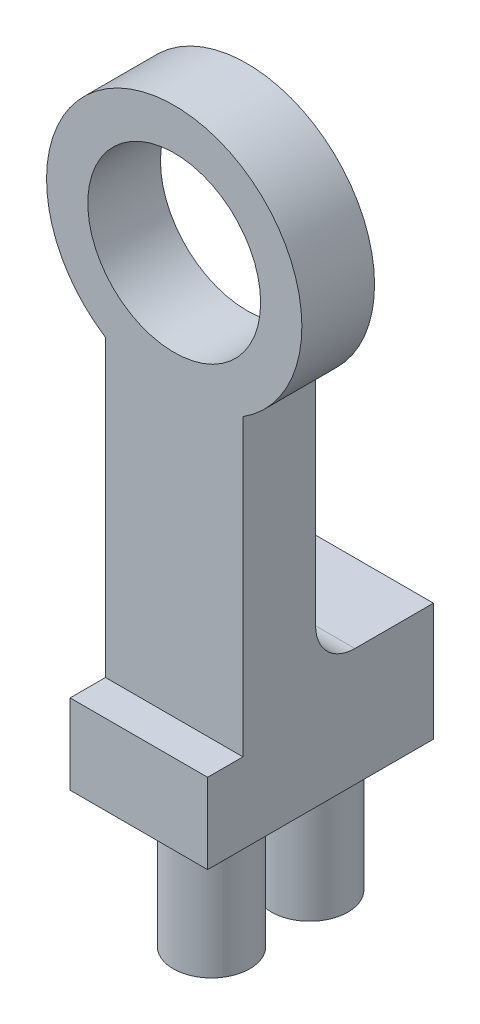
ISO-10303-21;
HEADER;
FILE_DESCRIPTION(('STEP AP214'),'2;1');
FILE_NAME('part.step','',(''),(''),'','','');
FILE_SCHEMA(('AUTOMOTIVE_DESIGN { 1 0 10303 214 1 1 1 1 }'));
ENDSEC;
DATA;
#1=APPLICATION_CONTEXT('core data for automotive mechanical design processes');
#2=APPLICATION_PROTOCOL_DEFINITION('international standard','automotive_design',2000,#1);
#3=PRODUCT_CONTEXT('',#1,'mechanical');
#4=PRODUCT('Part','Part','',(#3));
#5=PRODUCT_RELATED_PRODUCT_CATEGORY('part','',(#4));
#6=PRODUCT_DEFINITION_FORMATION('','',#4);
#7=PRODUCT_DEFINITION_CONTEXT('part definition',#1,'design');
#8=PRODUCT_DEFINITION('design','',#6,#7);
#9=PRODUCT_DEFINITION_SHAPE('','',#8);
#10=(LENGTH_UNIT() NAMED_UNIT(*) SI_UNIT(.MILLI.,.METRE.));
#11=(NAMED_UNIT(*) PLANE_ANGLE_UNIT() SI_UNIT($,.RADIAN.));
#12=(NAMED_UNIT(*) SI_UNIT($,.STERADIAN.) SOLID_ANGLE_UNIT());
#13=UNCERTAINTY_MEASURE_WITH_UNIT(LENGTH_MEASURE(1.E-05),#10,'distance_accuracy_value','');
#14=(GEOMETRIC_REPRESENTATION_CONTEXT(3) GLOBAL_UNCERTAINTY_ASSIGNED_CONTEXT((#13)) GLOBAL_UNIT_ASSIGNED_CONTEXT((#10,
#11,#12)) REPRESENTATION_CONTEXT('',''));
#15=CARTESIAN_POINT('',(0.,0.,0.));
#16=DIRECTION('',(0.,0.,1.));
#17=DIRECTION('',(1.,0.,0.));
#18=AXIS2_PLACEMENT_3D('',#15,#16,#17);
#19=CARTESIAN_POINT('',(0.,0.,3.7));
#20=DIRECTION('',(0.,0.,-1.));
#21=DIRECTION('',(-1.,0.,0.));
#22=AXIS2_PLACEMENT_3D('',#19,#20,#21);
#23=CYLINDRICAL_SURFACE('',#22,6.5);
#24=CARTESIAN_POINT('',(0.,0.,4.3));
#25=DIRECTION('',(0.,0.,1.));
#26=DIRECTION('',(1.,0.,0.));
#27=AXIS2_PLACEMENT_3D('',#24,#25,#26);
#28=CIRCLE('',#27,6.5);
#29=CARTESIAN_POINT('',(3.5,-5.47722557505166,4.3));
#30=VERTEX_POINT('',#29);
#31=CARTESIAN_POINT('',(-3.5,-5.47722557505166,4.3));
#32=VERTEX_POINT('',#31);
#33=EDGE_CURVE('E137',#30,#32,#28,.T.);
#34=ORIENTED_EDGE('',*,*,#33,.F.);
#35=DIRECTION('',(0.,0.,-1.));
#36=VECTOR('',#35,1.);
#37=CARTESIAN_POINT('',(3.5,-5.47722557505166,3.7));
#38=LINE('',#37,#36);
#39=CARTESIAN_POINT('',(3.5,-5.47722557505166,0.6));
#40=VERTEX_POINT('',#39);
#41=EDGE_CURVE('E221',#30,#40,#38,.T.);
#42=ORIENTED_EDGE('',*,*,#41,.T.);
#43=CARTESIAN_POINT('',(0.,0.,0.6));
#44=DIRECTION('',(0.,0.,-1.));
#45=DIRECTION('',(-1.,0.,0.));
#46=AXIS2_PLACEMENT_3D('',#43,#44,#45);
#47=CIRCLE('',#46,6.5);
#48=CARTESIAN_POINT('',(-3.5,-5.47722557505166,0.6));
#49=VERTEX_POINT('',#48);
#50=EDGE_CURVE('E204',#49,#40,#47,.T.);
#51=ORIENTED_EDGE('',*,*,#50,.F.);
#52=DIRECTION('',(0.,0.,-1.));
#53=VECTOR('',#52,1.);
#54=CARTESIAN_POINT('',(-3.5,-5.47722557505166,3.7));
#55=LINE('',#54,#53);
#56=EDGE_CURVE('E224',#32,#49,#55,.T.);
#57=ORIENTED_EDGE('',*,*,#56,.F.);
#58=EDGE_LOOP('',(#34,#42,#51,#57));
#59=FACE_BOUND('',#58,.T.);
#60=ADVANCED_FACE('F47',(#59),#23,.T.);
#61=CARTESIAN_POINT('',(0.,0.,-5.4));
#62=DIRECTION('',(0.,0.,1.));
#63=DIRECTION('',(1.,0.,0.));
#64=AXIS2_PLACEMENT_3D('',#61,#62,#63);
#65=CYLINDRICAL_SURFACE('',#64,4.4);
#66=CARTESIAN_POINT('',(0.,0.,0.6));
#67=DIRECTION('',(0.,0.,-1.));
#68=DIRECTION('',(-1.,0.,0.));
#69=AXIS2_PLACEMENT_3D('',#66,#67,#68);
#70=CIRCLE('',#69,4.4);
#71=CARTESIAN_POINT('',(-4.4,0.,0.6));
#72=VERTEX_POINT('',#71);
#73=EDGE_CURVE('E139',#72,#72,#70,.T.);
#74=ORIENTED_EDGE('',*,*,#73,.T.);
#75=EDGE_LOOP('',(#74));
#76=FACE_BOUND('',#75,.T.);
#77=CARTESIAN_POINT('',(0.,0.,4.3));
#78=DIRECTION('',(0.,0.,1.));
#79=DIRECTION('',(1.,0.,0.));
#80=AXIS2_PLACEMENT_3D('',#77,#78,#79);
#81=CIRCLE('',#80,4.4);
#82=CARTESIAN_POINT('',(4.4,0.,4.3));
#83=VERTEX_POINT('',#82);
#84=EDGE_CURVE('E51',#83,#83,#81,.F.);
#85=ORIENTED_EDGE('',*,*,#84,.F.);
#86=EDGE_LOOP('',(#85));
#87=FACE_BOUND('',#86,.T.);
#88=ADVANCED_FACE('F254',(#76,#87),#65,.F.);
#89=CARTESIAN_POINT('',(-3.5,0.,3.7));
#90=DIRECTION('',(1.,0.,0.));
#91=DIRECTION('',(0.,1.,0.));
#92=AXIS2_PLACEMENT_3D('',#89,#90,#91);
#93=PLANE('',#92);
#94=DIRECTION('',(0.,0.,1.));
#95=VECTOR('',#94,1.);
#96=CARTESIAN_POINT('',(-3.5,-20.4772255750517,4.6));
#97=LINE('',#96,#95);
#98=CARTESIAN_POINT('',(-3.5,-20.4772255750517,4.3));
#99=VERTEX_POINT('',#98);
#100=CARTESIAN_POINT('',(-3.5,-20.4772255750517,6.1));
#101=VERTEX_POINT('',#100);
#102=EDGE_CURVE('E64',#99,#101,#97,.T.);
#103=ORIENTED_EDGE('',*,*,#102,.F.);
#104=DIRECTION('',(0.,-1.,0.));
#105=VECTOR('',#104,1.);
#106=CARTESIAN_POINT('',(-3.5,0.,4.3));
#107=LINE('',#106,#105);
#108=EDGE_CURVE('E123',#32,#99,#107,.T.);
#109=ORIENTED_EDGE('',*,*,#108,.F.);
#110=ORIENTED_EDGE('',*,*,#56,.T.);
#111=DIRECTION('',(0.,1.,0.));
#112=VECTOR('',#111,1.);
#113=CARTESIAN_POINT('',(-3.5,0.,0.6));
#114=LINE('',#113,#112);
#115=CARTESIAN_POINT('',(-3.5,-16.55,0.6));
#116=VERTEX_POINT('',#115);
#117=EDGE_CURVE('E211',#116,#49,#114,.T.);
#118=ORIENTED_EDGE('',*,*,#117,.F.);
#119=CARTESIAN_POINT('',(-3.5,-16.55,-1.4));
#120=DIRECTION('',(1.,0.,0.));
#121=DIRECTION('',(0.,1.,0.));
#122=AXIS2_PLACEMENT_3D('',#119,#120,#121);
#123=CIRCLE('',#122,2.);
#124=CARTESIAN_POINT('',(-3.5,-18.55,-1.4));
#125=VERTEX_POINT('',#124);
#126=EDGE_CURVE('E172',#116,#125,#123,.T.);
#127=ORIENTED_EDGE('',*,*,#126,.T.);
#128=DIRECTION('',(0.,0.,-1.));
#129=VECTOR('',#128,1.);
#130=CARTESIAN_POINT('',(-3.5,-18.55,0.));
#131=LINE('',#130,#129);
#132=CARTESIAN_POINT('',(-3.5,-18.55,-5.4));
#133=VERTEX_POINT('',#132);
#134=EDGE_CURVE('E176',#125,#133,#131,.T.);
#135=ORIENTED_EDGE('',*,*,#134,.T.);
#136=DIRECTION('',(0.,-1.,0.));
#137=VECTOR('',#136,1.);
#138=CARTESIAN_POINT('',(-3.5,-18.55,-5.4));
#139=LINE('',#138,#137);
#140=CARTESIAN_POINT('',(-3.5,-24.55,-5.4));
#141=VERTEX_POINT('',#140);
#142=EDGE_CURVE('E183',#133,#141,#139,.T.);
#143=ORIENTED_EDGE('',*,*,#142,.T.);
#144=DIRECTION('',(0.,0.,1.));
#145=VECTOR('',#144,1.);
#146=CARTESIAN_POINT('',(-3.5,-24.55,3.7));
#147=LINE('',#146,#145);
#148=CARTESIAN_POINT('',(-3.5,-24.55,6.1));
#149=VERTEX_POINT('',#148);
#150=EDGE_CURVE('E201',#141,#149,#147,.T.);
#151=ORIENTED_EDGE('',*,*,#150,.T.);
#152=DIRECTION('',(0.,-1.,0.));
#153=VECTOR('',#152,1.);
#154=CARTESIAN_POINT('',(-3.5,-5.47722557505166,6.1));
#155=LINE('',#154,#153);
#156=EDGE_CURVE('E126',#101,#149,#155,.T.);
#157=ORIENTED_EDGE('',*,*,#156,.F.);
#158=EDGE_LOOP('',(#103,#109,#110,#118,#127,#135,#143,#151,#157));
#159=FACE_BOUND('',#158,.T.);
#160=ADVANCED_FACE('F122',(#159),#93,.F.);
#161=CARTESIAN_POINT('',(3.5,0.,3.7));
#162=DIRECTION('',(1.,0.,0.));
#163=DIRECTION('',(0.,1.,0.));
#164=AXIS2_PLACEMENT_3D('',#161,#162,#163);
#165=PLANE('',#164);
#166=DIRECTION('',(0.,-1.,0.));
#167=VECTOR('',#166,1.);
#168=CARTESIAN_POINT('',(3.5,0.,4.3));
#169=LINE('',#168,#167);
#170=CARTESIAN_POINT('',(3.5,-20.4772255750517,4.3));
#171=VERTEX_POINT('',#170);
#172=EDGE_CURVE('E147',#30,#171,#169,.T.);
#173=ORIENTED_EDGE('',*,*,#172,.T.);
#174=DIRECTION('',(0.,0.,1.));
#175=VECTOR('',#174,1.);
#176=CARTESIAN_POINT('',(3.5,-20.4772255750517,4.6));
#177=LINE('',#176,#175);
#178=CARTESIAN_POINT('',(3.5,-20.4772255750517,6.1));
#179=VERTEX_POINT('',#178);
#180=EDGE_CURVE('E128',#171,#179,#177,.T.);
#181=ORIENTED_EDGE('',*,*,#180,.T.);
#182=DIRECTION('',(0.,1.,0.));
#183=VECTOR('',#182,1.);
#184=CARTESIAN_POINT('',(3.5,-5.47722557505166,6.1));
#185=LINE('',#184,#183);
#186=CARTESIAN_POINT('',(3.5,-24.55,6.1));
#187=VERTEX_POINT('',#186);
#188=EDGE_CURVE('E217',#187,#179,#185,.T.);
#189=ORIENTED_EDGE('',*,*,#188,.F.);
#190=DIRECTION('',(0.,0.,1.));
#191=VECTOR('',#190,1.);
#192=CARTESIAN_POINT('',(3.5,-24.55,3.7));
#193=LINE('',#192,#191);
#194=CARTESIAN_POINT('',(3.5,-24.55,-5.4));
#195=VERTEX_POINT('',#194);
#196=EDGE_CURVE('E198',#195,#187,#193,.T.);
#197=ORIENTED_EDGE('',*,*,#196,.F.);
#198=DIRECTION('',(0.,-1.,0.));
#199=VECTOR('',#198,1.);
#200=CARTESIAN_POINT('',(3.5,-18.55,-5.4));
#201=LINE('',#200,#199);
#202=CARTESIAN_POINT('',(3.5,-18.55,-5.4));
#203=VERTEX_POINT('',#202);
#204=EDGE_CURVE('E187',#203,#195,#201,.T.);
#205=ORIENTED_EDGE('',*,*,#204,.F.);
#206=DIRECTION('',(0.,0.,-1.));
#207=VECTOR('',#206,1.);
#208=CARTESIAN_POINT('',(3.5,-18.55,0.));
#209=LINE('',#208,#207);
#210=CARTESIAN_POINT('',(3.5,-18.55,-1.4));
#211=VERTEX_POINT('',#210);
#212=EDGE_CURVE('E173',#211,#203,#209,.T.);
#213=ORIENTED_EDGE('',*,*,#212,.F.);
#214=CARTESIAN_POINT('',(3.5,-16.55,-1.4));
#215=DIRECTION('',(1.,0.,0.));
#216=DIRECTION('',(0.,1.,0.));
#217=AXIS2_PLACEMENT_3D('',#214,#215,#216);
#218=CIRCLE('',#217,2.);
#219=CARTESIAN_POINT('',(3.5,-16.55,0.6));
#220=VERTEX_POINT('',#219);
#221=EDGE_CURVE('E72',#211,#220,#218,.F.);
#222=ORIENTED_EDGE('',*,*,#221,.T.);
#223=DIRECTION('',(0.,1.,0.));
#224=VECTOR('',#223,1.);
#225=CARTESIAN_POINT('',(3.5,0.,0.6));
#226=LINE('',#225,#224);
#227=EDGE_CURVE('E208',#220,#40,#226,.T.);
#228=ORIENTED_EDGE('',*,*,#227,.T.);
#229=ORIENTED_EDGE('',*,*,#41,.F.);
#230=EDGE_LOOP('',(#173,#181,#189,#197,#205,#213,#222,#228,#229));
#231=FACE_BOUND('',#230,.T.);
#232=ADVANCED_FACE('F251',(#231),#165,.T.);
#233=CARTESIAN_POINT('',(0.,0.,6.1));
#234=DIRECTION('',(0.,0.,1.));
#235=DIRECTION('',(1.,0.,0.));
#236=AXIS2_PLACEMENT_3D('',#233,#234,#235);
#237=PLANE('',#236);
#238=DIRECTION('',(1.,0.,0.));
#239=VECTOR('',#238,1.);
#240=CARTESIAN_POINT('',(0.,-20.4772255750517,6.1));
#241=LINE('',#240,#239);
#242=EDGE_CURVE('E129',#101,#179,#241,.T.);
#243=ORIENTED_EDGE('',*,*,#242,.F.);
#244=ORIENTED_EDGE('',*,*,#156,.T.);
#245=DIRECTION('',(-1.,0.,0.));
#246=VECTOR('',#245,1.);
#247=CARTESIAN_POINT('',(-9.98505738314565,-24.55,6.1));
#248=LINE('',#247,#246);
#249=EDGE_CURVE('E191',#187,#149,#248,.T.);
#250=ORIENTED_EDGE('',*,*,#249,.F.);
#251=ORIENTED_EDGE('',*,*,#188,.T.);
#252=EDGE_LOOP('',(#243,#244,#250,#251));
#253=FACE_BOUND('',#252,.T.);
#254=ADVANCED_FACE('F266',(#253),#237,.T.);
#255=CARTESIAN_POINT('',(0.,0.,0.6));
#256=DIRECTION('',(0.,0.,-1.));
#257=DIRECTION('',(-1.,0.,0.));
#258=AXIS2_PLACEMENT_3D('',#255,#256,#257);
#259=PLANE('',#258);
#260=ORIENTED_EDGE('',*,*,#73,.F.);
#261=EDGE_LOOP('',(#260));
#262=FACE_BOUND('',#261,.T.);
#263=ORIENTED_EDGE('',*,*,#227,.F.);
#264=DIRECTION('',(1.,0.,0.));
#265=VECTOR('',#264,1.);
#266=CARTESIAN_POINT('',(0.,-16.55,0.6));
#267=LINE('',#266,#265);
#268=EDGE_CURVE('E231',#220,#116,#267,.F.);
#269=ORIENTED_EDGE('',*,*,#268,.T.);
#270=ORIENTED_EDGE('',*,*,#117,.T.);
#271=ORIENTED_EDGE('',*,*,#50,.T.);
#272=EDGE_LOOP('',(#263,#269,#270,#271));
#273=FACE_BOUND('',#272,.T.);
#274=ADVANCED_FACE('F248',(#262,#273),#259,.T.);
#275=CARTESIAN_POINT('',(-9.98505738314565,-24.55,-3.9));
#276=DIRECTION('',(0.,1.,0.));
#277=DIRECTION('',(0.,0.,1.));
#278=AXIS2_PLACEMENT_3D('',#275,#276,#277);
#279=PLANE('',#278);
#280=CARTESIAN_POINT('',(0.,-24.55,-2.6));
#281=DIRECTION('',(0.,1.,0.));
#282=DIRECTION('',(0.,0.,1.));
#283=AXIS2_PLACEMENT_3D('',#280,#281,#282);
#284=CIRCLE('',#283,1.95);
#285=CARTESIAN_POINT('',(0.,-24.55,-0.649999999999999));
#286=VERTEX_POINT('',#285);
#287=EDGE_CURVE('E11',#286,#286,#284,.F.);
#288=ORIENTED_EDGE('',*,*,#287,.F.);
#289=EDGE_LOOP('',(#288));
#290=FACE_BOUND('',#289,.T.);
#291=CARTESIAN_POINT('',(0.,-24.55,2.4));
#292=DIRECTION('',(0.,-1.,0.));
#293=DIRECTION('',(0.,0.,-1.));
#294=AXIS2_PLACEMENT_3D('',#291,#292,#293);
#295=CIRCLE('',#294,1.95);
#296=CARTESIAN_POINT('',(0.,-24.55,0.449999999999998));
#297=VERTEX_POINT('',#296);
#298=EDGE_CURVE('E57',#297,#297,#295,.T.);
#299=ORIENTED_EDGE('',*,*,#298,.F.);
#300=EDGE_LOOP('',(#299));
#301=FACE_BOUND('',#300,.T.);
#302=ORIENTED_EDGE('',*,*,#150,.F.);
#303=DIRECTION('',(1.,0.,0.));
#304=VECTOR('',#303,1.);
#305=CARTESIAN_POINT('',(0.,-24.55,-5.4));
#306=LINE('',#305,#304);
#307=EDGE_CURVE('E168',#141,#195,#306,.T.);
#308=ORIENTED_EDGE('',*,*,#307,.T.);
#309=ORIENTED_EDGE('',*,*,#196,.T.);
#310=ORIENTED_EDGE('',*,*,#249,.T.);
#311=EDGE_LOOP('',(#302,#308,#309,#310));
#312=FACE_BOUND('',#311,.T.);
#313=ADVANCED_FACE('F271',(#290,#301,#312),#279,.F.);
#314=CARTESIAN_POINT('',(0.,-18.55,-5.4));
#315=DIRECTION('',(0.,0.,-1.));
#316=DIRECTION('',(-1.,0.,0.));
#317=AXIS2_PLACEMENT_3D('',#314,#315,#316);
#318=PLANE('',#317);
#319=ORIENTED_EDGE('',*,*,#307,.F.);
#320=ORIENTED_EDGE('',*,*,#142,.F.);
#321=DIRECTION('',(1.,0.,0.));
#322=VECTOR('',#321,1.);
#323=CARTESIAN_POINT('',(0.,-18.55,-5.4));
#324=LINE('',#323,#322);
#325=EDGE_CURVE('E179',#133,#203,#324,.T.);
#326=ORIENTED_EDGE('',*,*,#325,.T.);
#327=ORIENTED_EDGE('',*,*,#204,.T.);
#328=EDGE_LOOP('',(#319,#320,#326,#327));
#329=FACE_BOUND('',#328,.T.);
#330=ADVANCED_FACE('F275',(#329),#318,.T.);
#331=CARTESIAN_POINT('',(0.,-18.55,0.));
#332=DIRECTION('',(0.,-1.,0.));
#333=DIRECTION('',(0.,0.,-1.));
#334=AXIS2_PLACEMENT_3D('',#331,#332,#333);
#335=PLANE('',#334);
#336=ORIENTED_EDGE('',*,*,#134,.F.);
#337=DIRECTION('',(1.,0.,0.));
#338=VECTOR('',#337,1.);
#339=CARTESIAN_POINT('',(0.,-18.55,-1.4));
#340=LINE('',#339,#338);
#341=EDGE_CURVE('E227',#125,#211,#340,.T.);
#342=ORIENTED_EDGE('',*,*,#341,.T.);
#343=ORIENTED_EDGE('',*,*,#212,.T.);
#344=ORIENTED_EDGE('',*,*,#325,.F.);
#345=EDGE_LOOP('',(#336,#342,#343,#344));
#346=FACE_BOUND('',#345,.T.);
#347=ADVANCED_FACE('F246',(#346),#335,.F.);
#348=CARTESIAN_POINT('',(0.,-16.55,-1.4));
#349=DIRECTION('',(1.,0.,0.));
#350=DIRECTION('',(0.,0.,-1.));
#351=AXIS2_PLACEMENT_3D('',#348,#349,#350);
#352=CYLINDRICAL_SURFACE('',#351,2.);
#353=ORIENTED_EDGE('',*,*,#126,.F.);
#354=ORIENTED_EDGE('',*,*,#268,.F.);
#355=ORIENTED_EDGE('',*,*,#221,.F.);
#356=ORIENTED_EDGE('',*,*,#341,.F.);
#357=EDGE_LOOP('',(#353,#354,#355,#356));
#358=FACE_BOUND('',#357,.T.);
#359=ADVANCED_FACE('F49',(#358),#352,.F.);
#360=CARTESIAN_POINT('',(0.,-31.55,2.4));
#361=DIRECTION('',(0.,1.,0.));
#362=DIRECTION('',(0.,0.,1.));
#363=AXIS2_PLACEMENT_3D('',#360,#361,#362);
#364=CYLINDRICAL_SURFACE('',#363,1.95);
#365=CARTESIAN_POINT('',(0.,-31.55,2.4));
#366=DIRECTION('',(0.,-1.,0.));
#367=DIRECTION('',(0.,0.,-1.));
#368=AXIS2_PLACEMENT_3D('',#365,#366,#367);
#369=CIRCLE('',#368,1.95);
#370=CARTESIAN_POINT('',(0.,-31.55,0.449999999999998));
#371=VERTEX_POINT('',#370);
#372=EDGE_CURVE('E164',#371,#371,#369,.T.);
#373=ORIENTED_EDGE('',*,*,#372,.F.);
#374=EDGE_LOOP('',(#373));
#375=FACE_BOUND('',#374,.T.);
#376=ORIENTED_EDGE('',*,*,#298,.T.);
#377=EDGE_LOOP('',(#376));
#378=FACE_BOUND('',#377,.T.);
#379=ADVANCED_FACE('F282',(#375,#378),#364,.T.);
#380=CARTESIAN_POINT('',(0.,-31.55,2.4));
#381=DIRECTION('',(0.,-1.,0.));
#382=DIRECTION('',(0.,0.,-1.));
#383=AXIS2_PLACEMENT_3D('',#380,#381,#382);
#384=PLANE('',#383);
#385=ORIENTED_EDGE('',*,*,#372,.T.);
#386=EDGE_LOOP('',(#385));
#387=FACE_BOUND('',#386,.T.);
#388=ADVANCED_FACE('F285',(#387),#384,.T.);
#389=CARTESIAN_POINT('',(0.,-31.55,-2.6));
#390=DIRECTION('',(0.,1.,0.));
#391=DIRECTION('',(0.,0.,1.));
#392=AXIS2_PLACEMENT_3D('',#389,#390,#391);
#393=CYLINDRICAL_SURFACE('',#392,1.95);
#394=CARTESIAN_POINT('',(0.,-31.55,-2.6));
#395=DIRECTION('',(0.,-1.,0.));
#396=DIRECTION('',(0.,0.,-1.));
#397=AXIS2_PLACEMENT_3D('',#394,#395,#396);
#398=CIRCLE('',#397,1.95);
#399=CARTESIAN_POINT('',(0.,-31.55,-4.55));
#400=VERTEX_POINT('',#399);
#401=EDGE_CURVE('E159',#400,#400,#398,.T.);
#402=ORIENTED_EDGE('',*,*,#401,.F.);
#403=EDGE_LOOP('',(#402));
#404=FACE_BOUND('',#403,.T.);
#405=ORIENTED_EDGE('',*,*,#287,.T.);
#406=EDGE_LOOP('',(#405));
#407=FACE_BOUND('',#406,.T.);
#408=ADVANCED_FACE('F289',(#404,#407),#393,.T.);
#409=CARTESIAN_POINT('',(0.,-31.55,-2.6));
#410=DIRECTION('',(0.,-1.,0.));
#411=DIRECTION('',(0.,0.,-1.));
#412=AXIS2_PLACEMENT_3D('',#409,#410,#411);
#413=PLANE('',#412);
#414=ORIENTED_EDGE('',*,*,#401,.T.);
#415=EDGE_LOOP('',(#414));
#416=FACE_BOUND('',#415,.T.);
#417=ADVANCED_FACE('F291',(#416),#413,.T.);
#418=CARTESIAN_POINT('',(0.,-20.4772255750517,4.6));
#419=DIRECTION('',(0.,-1.,0.));
#420=DIRECTION('',(0.,0.,-1.));
#421=AXIS2_PLACEMENT_3D('',#418,#419,#420);
#422=PLANE('',#421);
#423=ORIENTED_EDGE('',*,*,#242,.T.);
#424=ORIENTED_EDGE('',*,*,#180,.F.);
#425=DIRECTION('',(1.,0.,0.));
#426=VECTOR('',#425,1.);
#427=CARTESIAN_POINT('',(-10.7533696744231,-20.4772255750517,4.3));
#428=LINE('',#427,#426);
#429=EDGE_CURVE('E134',#99,#171,#428,.T.);
#430=ORIENTED_EDGE('',*,*,#429,.F.);
#431=ORIENTED_EDGE('',*,*,#102,.T.);
#432=EDGE_LOOP('',(#423,#424,#430,#431));
#433=FACE_BOUND('',#432,.T.);
#434=ADVANCED_FACE('F141',(#433),#422,.F.);
#435=CARTESIAN_POINT('',(0.,0.,4.3));
#436=DIRECTION('',(0.,0.,1.));
#437=DIRECTION('',(1.,0.,0.));
#438=AXIS2_PLACEMENT_3D('',#435,#436,#437);
#439=PLANE('',#438);
#440=ORIENTED_EDGE('',*,*,#84,.T.);
#441=EDGE_LOOP('',(#440));
#442=FACE_BOUND('',#441,.T.);
#443=ORIENTED_EDGE('',*,*,#108,.T.);
#444=ORIENTED_EDGE('',*,*,#429,.T.);
#445=ORIENTED_EDGE('',*,*,#172,.F.);
#446=ORIENTED_EDGE('',*,*,#33,.T.);
#447=EDGE_LOOP('',(#443,#444,#445,#446));
#448=FACE_BOUND('',#447,.T.);
#449=ADVANCED_FACE('F133',(#442,#448),#439,.T.);
#450=CLOSED_SHELL('',(#60,#88,#160,#232,#254,#274,#313,#330,#347,#359,#379,#388,#408,#417,#434,#449));
#451=MANIFOLD_SOLID_BREP('B2',#450);
#452=ADVANCED_BREP_SHAPE_REPRESENTATION('',(#18,#451),#14);
#453=SHAPE_DEFINITION_REPRESENTATION(#9,#452);
ENDSEC;
END-ISO-10303-21;
